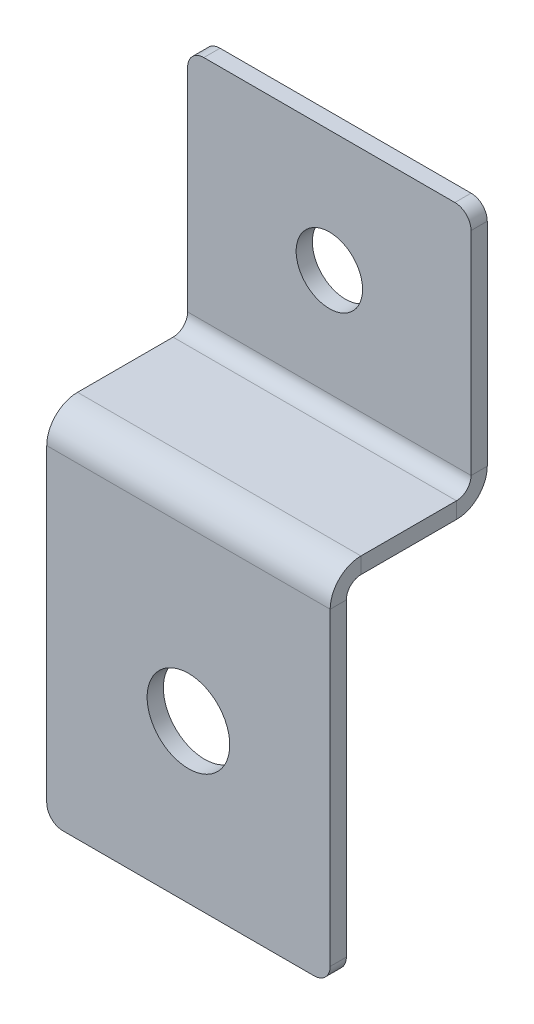
ISO-10303-21;
HEADER;
FILE_DESCRIPTION(('STEP AP214'),'2;1');
FILE_NAME('part.step','',(''),(''),'','','');
FILE_SCHEMA(('AUTOMOTIVE_DESIGN { 1 0 10303 214 1 1 1 1 }'));
ENDSEC;
DATA;
#1=APPLICATION_CONTEXT('core data for automotive mechanical design processes');
#2=APPLICATION_PROTOCOL_DEFINITION('international standard','automotive_design',2000,#1);
#3=PRODUCT_CONTEXT('',#1,'mechanical');
#4=PRODUCT('Part','Part','',(#3));
#5=PRODUCT_RELATED_PRODUCT_CATEGORY('part','',(#4));
#6=PRODUCT_DEFINITION_FORMATION('','',#4);
#7=PRODUCT_DEFINITION_CONTEXT('part definition',#1,'design');
#8=PRODUCT_DEFINITION('design','',#6,#7);
#9=PRODUCT_DEFINITION_SHAPE('','',#8);
#10=(LENGTH_UNIT() NAMED_UNIT(*) SI_UNIT(.MILLI.,.METRE.));
#11=(NAMED_UNIT(*) PLANE_ANGLE_UNIT() SI_UNIT($,.RADIAN.));
#12=(NAMED_UNIT(*) SI_UNIT($,.STERADIAN.) SOLID_ANGLE_UNIT());
#13=UNCERTAINTY_MEASURE_WITH_UNIT(LENGTH_MEASURE(1.E-05),#10,'distance_accuracy_value','');
#14=(GEOMETRIC_REPRESENTATION_CONTEXT(3) GLOBAL_UNCERTAINTY_ASSIGNED_CONTEXT((#13)) GLOBAL_UNIT_ASSIGNED_CONTEXT((#10,
#11,#12)) REPRESENTATION_CONTEXT('',''));
#15=CARTESIAN_POINT('',(0.,0.,0.));
#16=DIRECTION('',(0.,0.,1.));
#17=DIRECTION('',(1.,0.,0.));
#18=AXIS2_PLACEMENT_3D('',#15,#16,#17);
#19=CARTESIAN_POINT('',(16.609301381452,9.70798729366106,4.08315141283165));
#20=DIRECTION('',(1.,0.,0.));
#21=DIRECTION('',(0.,0.,-1.));
#22=AXIS2_PLACEMENT_3D('',#19,#20,#21);
#23=PLANE('',#22);
#24=DIRECTION('',(0.,-1.,0.));
#25=VECTOR('',#24,1.);
#26=CARTESIAN_POINT('',(16.609301381452,9.70798729366106,4.08315141283165));
#27=LINE('',#26,#25);
#28=CARTESIAN_POINT('',(16.609301381452,9.70798729366106,4.08315141283165));
#29=VERTEX_POINT('',#28);
#30=CARTESIAN_POINT('',(16.609301381452,7.70798729366106,4.08315141283165));
#31=VERTEX_POINT('',#30);
#32=EDGE_CURVE('E249',#29,#31,#27,.T.);
#33=ORIENTED_EDGE('',*,*,#32,.F.);
#34=CARTESIAN_POINT('',(16.609301381452,5.90798729366106,4.08315141283165));
#35=DIRECTION('',(1.,0.,0.));
#36=DIRECTION('',(0.,0.,-1.));
#37=AXIS2_PLACEMENT_3D('',#34,#35,#36);
#38=CIRCLE('',#37,3.8);
#39=CARTESIAN_POINT('',(16.609301381452,5.90798729366106,7.88315141283165));
#40=VERTEX_POINT('',#39);
#41=EDGE_CURVE('E165',#40,#29,#38,.F.);
#42=ORIENTED_EDGE('',*,*,#41,.F.);
#43=DIRECTION('',(0.,0.,1.));
#44=VECTOR('',#43,1.);
#45=CARTESIAN_POINT('',(16.609301381452,5.90798729366106,5.88315141283165));
#46=LINE('',#45,#44);
#47=CARTESIAN_POINT('',(16.609301381452,5.90798729366106,5.88315141283165));
#48=VERTEX_POINT('',#47);
#49=EDGE_CURVE('E246',#48,#40,#46,.T.);
#50=ORIENTED_EDGE('',*,*,#49,.F.);
#51=CARTESIAN_POINT('',(16.609301381452,5.90798729366106,4.08315141283165));
#52=DIRECTION('',(1.,0.,0.));
#53=DIRECTION('',(0.,0.,-1.));
#54=AXIS2_PLACEMENT_3D('',#51,#52,#53);
#55=CIRCLE('',#54,1.8);
#56=EDGE_CURVE('E175',#48,#31,#55,.F.);
#57=ORIENTED_EDGE('',*,*,#56,.T.);
#58=EDGE_LOOP('',(#33,#42,#50,#57));
#59=FACE_BOUND('',#58,.T.);
#60=ADVANCED_FACE('F16',(#59),#23,.T.);
#61=CARTESIAN_POINT('',(16.609301381452,5.90798729366106,5.88315141283165));
#62=DIRECTION('',(1.,0.,0.));
#63=DIRECTION('',(0.,0.,-1.));
#64=AXIS2_PLACEMENT_3D('',#61,#62,#63);
#65=PLANE('',#64);
#66=DIRECTION('',(0.,0.,-1.));
#67=VECTOR('',#66,1.);
#68=CARTESIAN_POINT('',(16.609301381452,9.70798729366106,7.88315141283165));
#69=LINE('',#68,#67);
#70=CARTESIAN_POINT('',(16.609301381452,9.70798729366106,-7.71684858716835));
#71=VERTEX_POINT('',#70);
#72=EDGE_CURVE('E163',#29,#71,#69,.T.);
#73=ORIENTED_EDGE('',*,*,#72,.F.);
#74=ORIENTED_EDGE('',*,*,#32,.T.);
#75=DIRECTION('',(0.,0.,-1.));
#76=VECTOR('',#75,1.);
#77=CARTESIAN_POINT('',(16.609301381452,7.70798729366106,7.88315141283165));
#78=LINE('',#77,#76);
#79=CARTESIAN_POINT('',(16.609301381452,7.70798729366107,-7.71684858716835));
#80=VERTEX_POINT('',#79);
#81=EDGE_CURVE('E178',#31,#80,#78,.T.);
#82=ORIENTED_EDGE('',*,*,#81,.T.);
#83=DIRECTION('',(0.,1.,0.));
#84=VECTOR('',#83,1.);
#85=CARTESIAN_POINT('',(16.609301381452,7.70798729366107,-7.71684858716835));
#86=LINE('',#85,#84);
#87=EDGE_CURVE('E143',#80,#71,#86,.T.);
#88=ORIENTED_EDGE('',*,*,#87,.T.);
#89=EDGE_LOOP('',(#73,#74,#82,#88));
#90=FACE_BOUND('',#89,.T.);
#91=ADVANCED_FACE('F323',(#90),#65,.T.);
#92=CARTESIAN_POINT('',(-18.390698618548,5.90798729366106,7.88315141283165));
#93=DIRECTION('',(-1.,0.,0.));
#94=DIRECTION('',(0.,0.,1.));
#95=AXIS2_PLACEMENT_3D('',#92,#93,#94);
#96=PLANE('',#95);
#97=DIRECTION('',(0.,0.,-1.));
#98=VECTOR('',#97,1.);
#99=CARTESIAN_POINT('',(-18.390698618548,5.90798729366106,7.88315141283165));
#100=LINE('',#99,#98);
#101=CARTESIAN_POINT('',(-18.390698618548,5.90798729366106,7.88315141283165));
#102=VERTEX_POINT('',#101);
#103=CARTESIAN_POINT('',(-18.390698618548,5.90798729366106,5.88315141283165));
#104=VERTEX_POINT('',#103);
#105=EDGE_CURVE('E243',#102,#104,#100,.T.);
#106=ORIENTED_EDGE('',*,*,#105,.F.);
#107=CARTESIAN_POINT('',(-18.390698618548,5.90798729366106,4.08315141283165));
#108=DIRECTION('',(1.,0.,0.));
#109=DIRECTION('',(0.,0.,-1.));
#110=AXIS2_PLACEMENT_3D('',#107,#108,#109);
#111=CIRCLE('',#110,3.8);
#112=CARTESIAN_POINT('',(-18.390698618548,9.70798729366106,4.08315141283165));
#113=VERTEX_POINT('',#112);
#114=EDGE_CURVE('E193',#102,#113,#111,.F.);
#115=ORIENTED_EDGE('',*,*,#114,.T.);
#116=DIRECTION('',(0.,1.,0.));
#117=VECTOR('',#116,1.);
#118=CARTESIAN_POINT('',(-18.390698618548,7.70798729366106,4.08315141283165));
#119=LINE('',#118,#117);
#120=CARTESIAN_POINT('',(-18.390698618548,7.70798729366106,4.08315141283165));
#121=VERTEX_POINT('',#120);
#122=EDGE_CURVE('E142',#121,#113,#119,.T.);
#123=ORIENTED_EDGE('',*,*,#122,.F.);
#124=CARTESIAN_POINT('',(-18.390698618548,5.90798729366106,4.08315141283165));
#125=DIRECTION('',(1.,0.,0.));
#126=DIRECTION('',(0.,0.,-1.));
#127=AXIS2_PLACEMENT_3D('',#124,#125,#126);
#128=CIRCLE('',#127,1.8);
#129=EDGE_CURVE('E200',#104,#121,#128,.F.);
#130=ORIENTED_EDGE('',*,*,#129,.F.);
#131=EDGE_LOOP('',(#106,#115,#123,#130));
#132=FACE_BOUND('',#131,.T.);
#133=ADVANCED_FACE('F329',(#132),#96,.T.);
#134=CARTESIAN_POINT('',(-18.390698618548,7.70798729366106,4.08315141283165));
#135=DIRECTION('',(-1.,0.,0.));
#136=DIRECTION('',(0.,0.,1.));
#137=AXIS2_PLACEMENT_3D('',#134,#135,#136);
#138=PLANE('',#137);
#139=DIRECTION('',(0.,1.,0.));
#140=VECTOR('',#139,1.);
#141=CARTESIAN_POINT('',(-18.390698618548,-34.2920127063389,5.88315141283165));
#142=LINE('',#141,#140);
#143=CARTESIAN_POINT('',(-18.390698618548,-32.2920127063389,5.88315141283165));
#144=VERTEX_POINT('',#143);
#145=EDGE_CURVE('E198',#144,#104,#142,.T.);
#146=ORIENTED_EDGE('',*,*,#145,.F.);
#147=DIRECTION('',(0.,0.,1.));
#148=VECTOR('',#147,1.);
#149=CARTESIAN_POINT('',(-18.390698618548,-32.2920127063389,4.08315141283165));
#150=LINE('',#149,#148);
#151=CARTESIAN_POINT('',(-18.390698618548,-32.2920127063389,7.88315141283165));
#152=VERTEX_POINT('',#151);
#153=EDGE_CURVE('E269',#144,#152,#150,.T.);
#154=ORIENTED_EDGE('',*,*,#153,.T.);
#155=DIRECTION('',(0.,1.,0.));
#156=VECTOR('',#155,1.);
#157=CARTESIAN_POINT('',(-18.390698618548,-34.2920127063389,7.88315141283165));
#158=LINE('',#157,#156);
#159=EDGE_CURVE('E196',#152,#102,#158,.T.);
#160=ORIENTED_EDGE('',*,*,#159,.T.);
#161=ORIENTED_EDGE('',*,*,#105,.T.);
#162=EDGE_LOOP('',(#146,#154,#160,#161));
#163=FACE_BOUND('',#162,.T.);
#164=ADVANCED_FACE('F389',(#163),#138,.T.);
#165=CARTESIAN_POINT('',(16.609301381452,11.5079872936611,-9.51684858716835));
#166=DIRECTION('',(1.,0.,0.));
#167=DIRECTION('',(0.,0.,-1.));
#168=AXIS2_PLACEMENT_3D('',#165,#166,#167);
#169=PLANE('',#168);
#170=DIRECTION('',(0.,0.,-1.));
#171=VECTOR('',#170,1.);
#172=CARTESIAN_POINT('',(16.609301381452,11.5079872936611,-9.51684858716835));
#173=LINE('',#172,#171);
#174=CARTESIAN_POINT('',(16.609301381452,11.5079872936611,-9.51684858716835));
#175=VERTEX_POINT('',#174);
#176=CARTESIAN_POINT('',(16.609301381452,11.5079872936611,-11.5168485871684));
#177=VERTEX_POINT('',#176);
#178=EDGE_CURVE('E133',#175,#177,#173,.T.);
#179=ORIENTED_EDGE('',*,*,#178,.F.);
#180=CARTESIAN_POINT('',(16.609301381452,11.5079872936611,-7.71684858716835));
#181=DIRECTION('',(-1.,0.,0.));
#182=DIRECTION('',(0.,0.,1.));
#183=AXIS2_PLACEMENT_3D('',#180,#181,#182);
#184=CIRCLE('',#183,1.8);
#185=EDGE_CURVE('E137',#71,#175,#184,.F.);
#186=ORIENTED_EDGE('',*,*,#185,.F.);
#187=ORIENTED_EDGE('',*,*,#87,.F.);
#188=CARTESIAN_POINT('',(16.609301381452,11.5079872936611,-7.71684858716835));
#189=DIRECTION('',(1.,0.,0.));
#190=DIRECTION('',(0.,0.,-1.));
#191=AXIS2_PLACEMENT_3D('',#188,#189,#190);
#192=CIRCLE('',#191,3.8);
#193=EDGE_CURVE('E140',#80,#177,#192,.T.);
#194=ORIENTED_EDGE('',*,*,#193,.T.);
#195=EDGE_LOOP('',(#179,#186,#187,#194));
#196=FACE_BOUND('',#195,.T.);
#197=ADVANCED_FACE('F135',(#196),#169,.T.);
#198=CARTESIAN_POINT('',(16.609301381452,7.70798729366107,-7.71684858716835));
#199=DIRECTION('',(1.,0.,0.));
#200=DIRECTION('',(0.,0.,-1.));
#201=AXIS2_PLACEMENT_3D('',#198,#199,#200);
#202=PLANE('',#201);
#203=DIRECTION('',(0.,1.,0.));
#204=VECTOR('',#203,1.);
#205=CARTESIAN_POINT('',(16.609301381452,9.70798729366106,-11.5168485871684));
#206=LINE('',#205,#204);
#207=CARTESIAN_POINT('',(16.609301381452,37.7079872936611,-11.5168485871684));
#208=VERTEX_POINT('',#207);
#209=EDGE_CURVE('E158',#177,#208,#206,.T.);
#210=ORIENTED_EDGE('',*,*,#209,.T.);
#211=DIRECTION('',(0.,0.,-1.));
#212=VECTOR('',#211,1.);
#213=CARTESIAN_POINT('',(16.609301381452,37.7079872936611,-7.71684858716835));
#214=LINE('',#213,#212);
#215=CARTESIAN_POINT('',(16.609301381452,37.7079872936611,-9.51684858716835));
#216=VERTEX_POINT('',#215);
#217=EDGE_CURVE('E39',#208,#216,#214,.F.);
#218=ORIENTED_EDGE('',*,*,#217,.T.);
#219=DIRECTION('',(0.,1.,0.));
#220=VECTOR('',#219,1.);
#221=CARTESIAN_POINT('',(16.609301381452,9.70798729366106,-9.51684858716835));
#222=LINE('',#221,#220);
#223=EDGE_CURVE('E148',#175,#216,#222,.T.);
#224=ORIENTED_EDGE('',*,*,#223,.F.);
#225=ORIENTED_EDGE('',*,*,#178,.T.);
#226=EDGE_LOOP('',(#210,#218,#224,#225));
#227=FACE_BOUND('',#226,.T.);
#228=ADVANCED_FACE('F157',(#227),#202,.T.);
#229=CARTESIAN_POINT('',(-18.390698618548,9.70798729366106,-7.71684858716835));
#230=DIRECTION('',(-1.,0.,0.));
#231=DIRECTION('',(0.,0.,1.));
#232=AXIS2_PLACEMENT_3D('',#229,#230,#231);
#233=PLANE('',#232);
#234=DIRECTION('',(0.,-1.,0.));
#235=VECTOR('',#234,1.);
#236=CARTESIAN_POINT('',(-18.390698618548,9.70798729366106,-7.71684858716835));
#237=LINE('',#236,#235);
#238=CARTESIAN_POINT('',(-18.390698618548,9.70798729366106,-7.71684858716835));
#239=VERTEX_POINT('',#238);
#240=CARTESIAN_POINT('',(-18.390698618548,7.70798729366107,-7.71684858716835));
#241=VERTEX_POINT('',#240);
#242=EDGE_CURVE('E239',#239,#241,#237,.T.);
#243=ORIENTED_EDGE('',*,*,#242,.F.);
#244=CARTESIAN_POINT('',(-18.390698618548,11.5079872936611,-7.71684858716835));
#245=DIRECTION('',(-1.,0.,0.));
#246=DIRECTION('',(0.,0.,1.));
#247=AXIS2_PLACEMENT_3D('',#244,#245,#246);
#248=CIRCLE('',#247,1.8);
#249=CARTESIAN_POINT('',(-18.390698618548,11.5079872936611,-9.51684858716835));
#250=VERTEX_POINT('',#249);
#251=EDGE_CURVE('E188',#239,#250,#248,.F.);
#252=ORIENTED_EDGE('',*,*,#251,.T.);
#253=DIRECTION('',(0.,0.,1.));
#254=VECTOR('',#253,1.);
#255=CARTESIAN_POINT('',(-18.390698618548,11.5079872936611,-11.5168485871684));
#256=LINE('',#255,#254);
#257=CARTESIAN_POINT('',(-18.390698618548,11.5079872936611,-11.5168485871684));
#258=VERTEX_POINT('',#257);
#259=EDGE_CURVE('E237',#258,#250,#256,.T.);
#260=ORIENTED_EDGE('',*,*,#259,.F.);
#261=CARTESIAN_POINT('',(-18.390698618548,11.5079872936611,-7.71684858716835));
#262=DIRECTION('',(1.,0.,0.));
#263=DIRECTION('',(0.,0.,-1.));
#264=AXIS2_PLACEMENT_3D('',#261,#262,#263);
#265=CIRCLE('',#264,3.8);
#266=EDGE_CURVE('E206',#241,#258,#265,.T.);
#267=ORIENTED_EDGE('',*,*,#266,.F.);
#268=EDGE_LOOP('',(#243,#252,#260,#267));
#269=FACE_BOUND('',#268,.T.);
#270=ADVANCED_FACE('F356',(#269),#233,.T.);
#271=CARTESIAN_POINT('',(-18.390698618548,11.5079872936611,-11.5168485871684));
#272=DIRECTION('',(-1.,0.,0.));
#273=DIRECTION('',(0.,0.,1.));
#274=AXIS2_PLACEMENT_3D('',#271,#272,#273);
#275=PLANE('',#274);
#276=DIRECTION('',(0.,0.,-1.));
#277=VECTOR('',#276,1.);
#278=CARTESIAN_POINT('',(-18.390698618548,9.70798729366106,7.88315141283165));
#279=LINE('',#278,#277);
#280=EDGE_CURVE('E190',#113,#239,#279,.T.);
#281=ORIENTED_EDGE('',*,*,#280,.T.);
#282=ORIENTED_EDGE('',*,*,#242,.T.);
#283=DIRECTION('',(0.,0.,-1.));
#284=VECTOR('',#283,1.);
#285=CARTESIAN_POINT('',(-18.390698618548,7.70798729366106,7.88315141283165));
#286=LINE('',#285,#284);
#287=EDGE_CURVE('E203',#121,#241,#286,.T.);
#288=ORIENTED_EDGE('',*,*,#287,.F.);
#289=ORIENTED_EDGE('',*,*,#122,.T.);
#290=EDGE_LOOP('',(#281,#282,#288,#289));
#291=FACE_BOUND('',#290,.T.);
#292=ADVANCED_FACE('F359',(#291),#275,.T.);
#293=CARTESIAN_POINT('',(16.609301381452,9.70798729366106,-11.5168485871684));
#294=DIRECTION('',(0.,0.,1.));
#295=DIRECTION('',(1.,0.,0.));
#296=AXIS2_PLACEMENT_3D('',#293,#294,#295);
#297=PLANE('',#296);
#298=CARTESIAN_POINT('',(-0.890698618547958,24.7079872936611,-11.5168485871684));
#299=DIRECTION('',(0.,0.,1.));
#300=DIRECTION('',(1.,0.,0.));
#301=AXIS2_PLACEMENT_3D('',#298,#299,#300);
#302=CIRCLE('',#301,4.1);
#303=CARTESIAN_POINT('',(3.20930138145204,24.7079872936611,-11.5168485871684));
#304=VERTEX_POINT('',#303);
#305=EDGE_CURVE('E296',#304,#304,#302,.T.);
#306=ORIENTED_EDGE('',*,*,#305,.T.);
#307=EDGE_LOOP('',(#306));
#308=FACE_BOUND('',#307,.T.);
#309=DIRECTION('',(-1.,0.,0.));
#310=VECTOR('',#309,1.);
#311=CARTESIAN_POINT('',(16.609301381452,39.7079872936611,-11.5168485871684));
#312=LINE('',#311,#310);
#313=CARTESIAN_POINT('',(14.609301381452,39.7079872936611,-11.5168485871684));
#314=VERTEX_POINT('',#313);
#315=CARTESIAN_POINT('',(-16.390698618548,39.7079872936611,-11.5168485871684));
#316=VERTEX_POINT('',#315);
#317=EDGE_CURVE('E234',#314,#316,#312,.T.);
#318=ORIENTED_EDGE('',*,*,#317,.F.);
#319=CARTESIAN_POINT('',(14.609301381452,37.7079872936611,-11.5168485871684));
#320=DIRECTION('',(0.,0.,1.));
#321=DIRECTION('',(1.,0.,0.));
#322=AXIS2_PLACEMENT_3D('',#319,#320,#321);
#323=CIRCLE('',#322,2.);
#324=EDGE_CURVE('E279',#314,#208,#323,.F.);
#325=ORIENTED_EDGE('',*,*,#324,.T.);
#326=ORIENTED_EDGE('',*,*,#209,.F.);
#327=DIRECTION('',(-1.,0.,0.));
#328=VECTOR('',#327,1.);
#329=CARTESIAN_POINT('',(16.609301381452,11.5079872936611,-11.5168485871684));
#330=LINE('',#329,#328);
#331=EDGE_CURVE('E182',#177,#258,#330,.T.);
#332=ORIENTED_EDGE('',*,*,#331,.T.);
#333=DIRECTION('',(0.,1.,0.));
#334=VECTOR('',#333,1.);
#335=CARTESIAN_POINT('',(-18.390698618548,9.70798729366106,-11.5168485871684));
#336=LINE('',#335,#334);
#337=CARTESIAN_POINT('',(-18.390698618548,37.7079872936611,-11.5168485871684));
#338=VERTEX_POINT('',#337);
#339=EDGE_CURVE('E183',#258,#338,#336,.T.);
#340=ORIENTED_EDGE('',*,*,#339,.T.);
#341=CARTESIAN_POINT('',(-16.390698618548,37.7079872936611,-11.5168485871684));
#342=DIRECTION('',(0.,0.,1.));
#343=DIRECTION('',(1.,0.,0.));
#344=AXIS2_PLACEMENT_3D('',#341,#342,#343);
#345=CIRCLE('',#344,2.);
#346=EDGE_CURVE('E277',#338,#316,#345,.F.);
#347=ORIENTED_EDGE('',*,*,#346,.T.);
#348=EDGE_LOOP('',(#318,#325,#326,#332,#340,#347));
#349=FACE_BOUND('',#348,.T.);
#350=ADVANCED_FACE('F292',(#308,#349),#297,.F.);
#351=CARTESIAN_POINT('',(16.609301381452,39.7079872936611,-9.51684858716835));
#352=DIRECTION('',(0.,1.,0.));
#353=DIRECTION('',(0.,0.,1.));
#354=AXIS2_PLACEMENT_3D('',#351,#352,#353);
#355=PLANE('',#354);
#356=DIRECTION('',(-1.,0.,0.));
#357=VECTOR('',#356,1.);
#358=CARTESIAN_POINT('',(16.609301381452,39.7079872936611,-9.51684858716835));
#359=LINE('',#358,#357);
#360=CARTESIAN_POINT('',(14.609301381452,39.7079872936611,-9.51684858716835));
#361=VERTEX_POINT('',#360);
#362=CARTESIAN_POINT('',(-16.390698618548,39.7079872936611,-9.51684858716835));
#363=VERTEX_POINT('',#362);
#364=EDGE_CURVE('E154',#361,#363,#359,.T.);
#365=ORIENTED_EDGE('',*,*,#364,.F.);
#366=DIRECTION('',(0.,0.,-1.));
#367=VECTOR('',#366,1.);
#368=CARTESIAN_POINT('',(14.609301381452,39.7079872936611,-9.51684858716835));
#369=LINE('',#368,#367);
#370=EDGE_CURVE('E274',#361,#314,#369,.T.);
#371=ORIENTED_EDGE('',*,*,#370,.T.);
#372=ORIENTED_EDGE('',*,*,#317,.T.);
#373=DIRECTION('',(0.,0.,-1.));
#374=VECTOR('',#373,1.);
#375=CARTESIAN_POINT('',(-16.390698618548,39.7079872936611,-9.51684858716835));
#376=LINE('',#375,#374);
#377=EDGE_CURVE('E272',#316,#363,#376,.F.);
#378=ORIENTED_EDGE('',*,*,#377,.T.);
#379=EDGE_LOOP('',(#365,#371,#372,#378));
#380=FACE_BOUND('',#379,.T.);
#381=ADVANCED_FACE('F286',(#380),#355,.T.);
#382=CARTESIAN_POINT('',(16.609301381452,9.70798729366106,-9.51684858716835));
#383=DIRECTION('',(0.,0.,1.));
#384=DIRECTION('',(1.,0.,0.));
#385=AXIS2_PLACEMENT_3D('',#382,#383,#384);
#386=PLANE('',#385);
#387=CARTESIAN_POINT('',(-0.890698618547958,24.7079872936611,-9.51684858716835));
#388=DIRECTION('',(0.,0.,1.));
#389=DIRECTION('',(1.,0.,0.));
#390=AXIS2_PLACEMENT_3D('',#387,#388,#389);
#391=CIRCLE('',#390,4.1);
#392=CARTESIAN_POINT('',(3.20930138145204,24.7079872936611,-9.51684858716835));
#393=VERTEX_POINT('',#392);
#394=EDGE_CURVE('E297',#393,#393,#391,.T.);
#395=ORIENTED_EDGE('',*,*,#394,.F.);
#396=EDGE_LOOP('',(#395));
#397=FACE_BOUND('',#396,.T.);
#398=ORIENTED_EDGE('',*,*,#223,.T.);
#399=CARTESIAN_POINT('',(14.609301381452,37.7079872936611,-9.51684858716835));
#400=DIRECTION('',(0.,0.,1.));
#401=DIRECTION('',(1.,0.,0.));
#402=AXIS2_PLACEMENT_3D('',#399,#400,#401);
#403=CIRCLE('',#402,2.);
#404=EDGE_CURVE('E24',#216,#361,#403,.T.);
#405=ORIENTED_EDGE('',*,*,#404,.T.);
#406=ORIENTED_EDGE('',*,*,#364,.T.);
#407=CARTESIAN_POINT('',(-16.390698618548,37.7079872936611,-9.51684858716835));
#408=DIRECTION('',(0.,0.,1.));
#409=DIRECTION('',(1.,0.,0.));
#410=AXIS2_PLACEMENT_3D('',#407,#408,#409);
#411=CIRCLE('',#410,2.);
#412=CARTESIAN_POINT('',(-18.390698618548,37.7079872936611,-9.51684858716835));
#413=VERTEX_POINT('',#412);
#414=EDGE_CURVE('E31',#363,#413,#411,.T.);
#415=ORIENTED_EDGE('',*,*,#414,.T.);
#416=DIRECTION('',(0.,1.,0.));
#417=VECTOR('',#416,1.);
#418=CARTESIAN_POINT('',(-18.390698618548,9.70798729366106,-9.51684858716835));
#419=LINE('',#418,#417);
#420=EDGE_CURVE('E150',#250,#413,#419,.T.);
#421=ORIENTED_EDGE('',*,*,#420,.F.);
#422=DIRECTION('',(-1.,0.,0.));
#423=VECTOR('',#422,1.);
#424=CARTESIAN_POINT('',(16.609301381452,11.5079872936611,-9.51684858716835));
#425=LINE('',#424,#423);
#426=EDGE_CURVE('E146',#175,#250,#425,.T.);
#427=ORIENTED_EDGE('',*,*,#426,.F.);
#428=EDGE_LOOP('',(#398,#405,#406,#415,#421,#427));
#429=FACE_BOUND('',#428,.T.);
#430=ADVANCED_FACE('F147',(#397,#429),#386,.T.);
#431=CARTESIAN_POINT('',(16.609301381452,11.5079872936611,-7.71684858716835));
#432=DIRECTION('',(-1.,0.,0.));
#433=DIRECTION('',(0.,0.,1.));
#434=AXIS2_PLACEMENT_3D('',#431,#432,#433);
#435=CYLINDRICAL_SURFACE('',#434,1.8);
#436=ORIENTED_EDGE('',*,*,#251,.F.);
#437=DIRECTION('',(-1.,0.,0.));
#438=VECTOR('',#437,1.);
#439=CARTESIAN_POINT('',(16.609301381452,9.70798729366106,-7.71684858716835));
#440=LINE('',#439,#438);
#441=EDGE_CURVE('E155',#71,#239,#440,.T.);
#442=ORIENTED_EDGE('',*,*,#441,.F.);
#443=ORIENTED_EDGE('',*,*,#185,.T.);
#444=ORIENTED_EDGE('',*,*,#426,.T.);
#445=EDGE_LOOP('',(#436,#442,#443,#444));
#446=FACE_BOUND('',#445,.T.);
#447=ADVANCED_FACE('F161',(#446),#435,.F.);
#448=CARTESIAN_POINT('',(16.609301381452,9.70798729366106,7.88315141283165));
#449=DIRECTION('',(0.,1.,0.));
#450=DIRECTION('',(0.,0.,1.));
#451=AXIS2_PLACEMENT_3D('',#448,#449,#450);
#452=PLANE('',#451);
#453=ORIENTED_EDGE('',*,*,#280,.F.);
#454=DIRECTION('',(-1.,0.,0.));
#455=VECTOR('',#454,1.);
#456=CARTESIAN_POINT('',(16.609301381452,9.70798729366106,4.08315141283165));
#457=LINE('',#456,#455);
#458=EDGE_CURVE('E229',#29,#113,#457,.T.);
#459=ORIENTED_EDGE('',*,*,#458,.F.);
#460=ORIENTED_EDGE('',*,*,#72,.T.);
#461=ORIENTED_EDGE('',*,*,#441,.T.);
#462=EDGE_LOOP('',(#453,#459,#460,#461));
#463=FACE_BOUND('',#462,.T.);
#464=ADVANCED_FACE('F319',(#463),#452,.T.);
#465=CARTESIAN_POINT('',(16.609301381452,5.90798729366106,4.08315141283165));
#466=DIRECTION('',(-1.,0.,0.));
#467=DIRECTION('',(0.,0.,1.));
#468=AXIS2_PLACEMENT_3D('',#465,#466,#467);
#469=CYLINDRICAL_SURFACE('',#468,3.8);
#470=ORIENTED_EDGE('',*,*,#114,.F.);
#471=DIRECTION('',(-1.,0.,0.));
#472=VECTOR('',#471,1.);
#473=CARTESIAN_POINT('',(16.609301381452,5.90798729366106,7.88315141283165));
#474=LINE('',#473,#472);
#475=EDGE_CURVE('E226',#40,#102,#474,.T.);
#476=ORIENTED_EDGE('',*,*,#475,.F.);
#477=ORIENTED_EDGE('',*,*,#41,.T.);
#478=ORIENTED_EDGE('',*,*,#458,.T.);
#479=EDGE_LOOP('',(#470,#476,#477,#478));
#480=FACE_BOUND('',#479,.T.);
#481=ADVANCED_FACE('F370',(#480),#469,.T.);
#482=CARTESIAN_POINT('',(16.609301381452,-34.2920127063389,7.88315141283165));
#483=DIRECTION('',(0.,0.,1.));
#484=DIRECTION('',(1.,0.,0.));
#485=AXIS2_PLACEMENT_3D('',#482,#483,#484);
#486=PLANE('',#485);
#487=CARTESIAN_POINT('',(-0.890698618547958,-14.7920127063389,7.88315141283165));
#488=DIRECTION('',(0.,0.,1.));
#489=DIRECTION('',(1.,0.,0.));
#490=AXIS2_PLACEMENT_3D('',#487,#488,#489);
#491=CIRCLE('',#490,5.1);
#492=CARTESIAN_POINT('',(4.20930138145204,-14.7920127063389,7.88315141283165));
#493=VERTEX_POINT('',#492);
#494=EDGE_CURVE('E254',#493,#493,#491,.T.);
#495=ORIENTED_EDGE('',*,*,#494,.F.);
#496=EDGE_LOOP('',(#495));
#497=FACE_BOUND('',#496,.T.);
#498=DIRECTION('',(-1.,0.,0.));
#499=VECTOR('',#498,1.);
#500=CARTESIAN_POINT('',(16.609301381452,-34.2920127063389,7.88315141283165));
#501=LINE('',#500,#499);
#502=CARTESIAN_POINT('',(14.609301381452,-34.2920127063389,7.88315141283165));
#503=VERTEX_POINT('',#502);
#504=CARTESIAN_POINT('',(-16.390698618548,-34.2920127063389,7.88315141283165));
#505=VERTEX_POINT('',#504);
#506=EDGE_CURVE('E223',#503,#505,#501,.T.);
#507=ORIENTED_EDGE('',*,*,#506,.F.);
#508=CARTESIAN_POINT('',(14.609301381452,-32.2920127063389,7.88315141283165));
#509=DIRECTION('',(0.,0.,1.));
#510=DIRECTION('',(1.,0.,0.));
#511=AXIS2_PLACEMENT_3D('',#508,#509,#510);
#512=CIRCLE('',#511,2.);
#513=CARTESIAN_POINT('',(16.609301381452,-32.2920127063389,7.88315141283165));
#514=VERTEX_POINT('',#513);
#515=EDGE_CURVE('E261',#503,#514,#512,.T.);
#516=ORIENTED_EDGE('',*,*,#515,.T.);
#517=DIRECTION('',(0.,1.,0.));
#518=VECTOR('',#517,1.);
#519=CARTESIAN_POINT('',(16.609301381452,-34.2920127063389,7.88315141283165));
#520=LINE('',#519,#518);
#521=EDGE_CURVE('E171',#514,#40,#520,.T.);
#522=ORIENTED_EDGE('',*,*,#521,.T.);
#523=ORIENTED_EDGE('',*,*,#475,.T.);
#524=ORIENTED_EDGE('',*,*,#159,.F.);
#525=CARTESIAN_POINT('',(-16.390698618548,-32.2920127063389,7.88315141283165));
#526=DIRECTION('',(0.,0.,1.));
#527=DIRECTION('',(1.,0.,0.));
#528=AXIS2_PLACEMENT_3D('',#525,#526,#527);
#529=CIRCLE('',#528,2.);
#530=EDGE_CURVE('E259',#152,#505,#529,.T.);
#531=ORIENTED_EDGE('',*,*,#530,.T.);
#532=EDGE_LOOP('',(#507,#516,#522,#523,#524,#531));
#533=FACE_BOUND('',#532,.T.);
#534=ADVANCED_FACE('F393',(#497,#533),#486,.T.);
#535=CARTESIAN_POINT('',(16.609301381452,-34.2920127063389,5.88315141283165));
#536=DIRECTION('',(0.,-1.,0.));
#537=DIRECTION('',(0.,0.,-1.));
#538=AXIS2_PLACEMENT_3D('',#535,#536,#537);
#539=PLANE('',#538);
#540=DIRECTION('',(-1.,0.,0.));
#541=VECTOR('',#540,1.);
#542=CARTESIAN_POINT('',(16.609301381452,-34.2920127063389,5.88315141283165));
#543=LINE('',#542,#541);
#544=CARTESIAN_POINT('',(14.609301381452,-34.2920127063389,5.88315141283165));
#545=VERTEX_POINT('',#544);
#546=CARTESIAN_POINT('',(-16.390698618548,-34.2920127063389,5.88315141283165));
#547=VERTEX_POINT('',#546);
#548=EDGE_CURVE('E220',#545,#547,#543,.T.);
#549=ORIENTED_EDGE('',*,*,#548,.F.);
#550=DIRECTION('',(0.,0.,1.));
#551=VECTOR('',#550,1.);
#552=CARTESIAN_POINT('',(14.609301381452,-34.2920127063389,7.88315141283165));
#553=LINE('',#552,#551);
#554=EDGE_CURVE('E256',#545,#503,#553,.T.);
#555=ORIENTED_EDGE('',*,*,#554,.T.);
#556=ORIENTED_EDGE('',*,*,#506,.T.);
#557=DIRECTION('',(0.,0.,1.));
#558=VECTOR('',#557,1.);
#559=CARTESIAN_POINT('',(-16.390698618548,-34.2920127063389,5.88315141283165));
#560=LINE('',#559,#558);
#561=EDGE_CURVE('E251',#505,#547,#560,.F.);
#562=ORIENTED_EDGE('',*,*,#561,.T.);
#563=EDGE_LOOP('',(#549,#555,#556,#562));
#564=FACE_BOUND('',#563,.T.);
#565=ADVANCED_FACE('F401',(#564),#539,.T.);
#566=CARTESIAN_POINT('',(16.609301381452,-34.2920127063389,5.88315141283165));
#567=DIRECTION('',(0.,0.,1.));
#568=DIRECTION('',(1.,0.,0.));
#569=AXIS2_PLACEMENT_3D('',#566,#567,#568);
#570=PLANE('',#569);
#571=CARTESIAN_POINT('',(-0.890698618547958,-14.7920127063389,5.88315141283165));
#572=DIRECTION('',(0.,0.,1.));
#573=DIRECTION('',(1.,0.,0.));
#574=AXIS2_PLACEMENT_3D('',#571,#572,#573);
#575=CIRCLE('',#574,5.1);
#576=CARTESIAN_POINT('',(4.20930138145204,-14.7920127063389,5.88315141283165));
#577=VERTEX_POINT('',#576);
#578=EDGE_CURVE('E186',#577,#577,#575,.T.);
#579=ORIENTED_EDGE('',*,*,#578,.T.);
#580=EDGE_LOOP('',(#579));
#581=FACE_BOUND('',#580,.T.);
#582=DIRECTION('',(0.,1.,0.));
#583=VECTOR('',#582,1.);
#584=CARTESIAN_POINT('',(16.609301381452,-34.2920127063389,5.88315141283165));
#585=LINE('',#584,#583);
#586=CARTESIAN_POINT('',(16.609301381452,-32.2920127063389,5.88315141283165));
#587=VERTEX_POINT('',#586);
#588=EDGE_CURVE('E173',#587,#48,#585,.T.);
#589=ORIENTED_EDGE('',*,*,#588,.F.);
#590=CARTESIAN_POINT('',(14.609301381452,-32.2920127063389,5.88315141283165));
#591=DIRECTION('',(0.,0.,1.));
#592=DIRECTION('',(1.,0.,0.));
#593=AXIS2_PLACEMENT_3D('',#590,#591,#592);
#594=CIRCLE('',#593,2.);
#595=EDGE_CURVE('E267',#587,#545,#594,.F.);
#596=ORIENTED_EDGE('',*,*,#595,.T.);
#597=ORIENTED_EDGE('',*,*,#548,.T.);
#598=CARTESIAN_POINT('',(-16.390698618548,-32.2920127063389,5.88315141283165));
#599=DIRECTION('',(0.,0.,1.));
#600=DIRECTION('',(1.,0.,0.));
#601=AXIS2_PLACEMENT_3D('',#598,#599,#600);
#602=CIRCLE('',#601,2.);
#603=EDGE_CURVE('E265',#547,#144,#602,.F.);
#604=ORIENTED_EDGE('',*,*,#603,.T.);
#605=ORIENTED_EDGE('',*,*,#145,.T.);
#606=DIRECTION('',(-1.,0.,0.));
#607=VECTOR('',#606,1.);
#608=CARTESIAN_POINT('',(16.609301381452,5.90798729366106,5.88315141283165));
#609=LINE('',#608,#607);
#610=EDGE_CURVE('E217',#48,#104,#609,.T.);
#611=ORIENTED_EDGE('',*,*,#610,.F.);
#612=EDGE_LOOP('',(#589,#596,#597,#604,#605,#611));
#613=FACE_BOUND('',#612,.T.);
#614=ADVANCED_FACE('F383',(#581,#613),#570,.F.);
#615=CARTESIAN_POINT('',(16.609301381452,5.90798729366106,4.08315141283165));
#616=DIRECTION('',(-1.,0.,0.));
#617=DIRECTION('',(0.,0.,1.));
#618=AXIS2_PLACEMENT_3D('',#615,#616,#617);
#619=CYLINDRICAL_SURFACE('',#618,1.8);
#620=ORIENTED_EDGE('',*,*,#129,.T.);
#621=DIRECTION('',(-1.,0.,0.));
#622=VECTOR('',#621,1.);
#623=CARTESIAN_POINT('',(16.609301381452,7.70798729366106,4.08315141283165));
#624=LINE('',#623,#622);
#625=EDGE_CURVE('E214',#31,#121,#624,.T.);
#626=ORIENTED_EDGE('',*,*,#625,.F.);
#627=ORIENTED_EDGE('',*,*,#56,.F.);
#628=ORIENTED_EDGE('',*,*,#610,.T.);
#629=EDGE_LOOP('',(#620,#626,#627,#628));
#630=FACE_BOUND('',#629,.T.);
#631=ADVANCED_FACE('F380',(#630),#619,.F.);
#632=CARTESIAN_POINT('',(16.609301381452,7.70798729366106,7.88315141283165));
#633=DIRECTION('',(0.,1.,0.));
#634=DIRECTION('',(0.,0.,1.));
#635=AXIS2_PLACEMENT_3D('',#632,#633,#634);
#636=PLANE('',#635);
#637=ORIENTED_EDGE('',*,*,#287,.T.);
#638=DIRECTION('',(-1.,0.,0.));
#639=VECTOR('',#638,1.);
#640=CARTESIAN_POINT('',(16.609301381452,7.70798729366107,-7.71684858716835));
#641=LINE('',#640,#639);
#642=EDGE_CURVE('E211',#80,#241,#641,.T.);
#643=ORIENTED_EDGE('',*,*,#642,.F.);
#644=ORIENTED_EDGE('',*,*,#81,.F.);
#645=ORIENTED_EDGE('',*,*,#625,.T.);
#646=EDGE_LOOP('',(#637,#643,#644,#645));
#647=FACE_BOUND('',#646,.T.);
#648=ADVANCED_FACE('F378',(#647),#636,.F.);
#649=CARTESIAN_POINT('',(16.609301381452,11.5079872936611,-7.71684858716835));
#650=DIRECTION('',(-1.,0.,0.));
#651=DIRECTION('',(0.,0.,1.));
#652=AXIS2_PLACEMENT_3D('',#649,#650,#651);
#653=CYLINDRICAL_SURFACE('',#652,3.8);
#654=ORIENTED_EDGE('',*,*,#266,.T.);
#655=ORIENTED_EDGE('',*,*,#331,.F.);
#656=ORIENTED_EDGE('',*,*,#193,.F.);
#657=ORIENTED_EDGE('',*,*,#642,.T.);
#658=EDGE_LOOP('',(#654,#655,#656,#657));
#659=FACE_BOUND('',#658,.T.);
#660=ADVANCED_FACE('F352',(#659),#653,.T.);
#661=CARTESIAN_POINT('',(16.609301381452,11.5079872936611,-7.71684858716835));
#662=DIRECTION('',(-1.,0.,0.));
#663=DIRECTION('',(0.,0.,1.));
#664=AXIS2_PLACEMENT_3D('',#661,#662,#663);
#665=PLANE('',#664);
#666=ORIENTED_EDGE('',*,*,#521,.F.);
#667=DIRECTION('',(0.,0.,1.));
#668=VECTOR('',#667,1.);
#669=CARTESIAN_POINT('',(16.609301381452,-32.2920127063389,5.88315141283165));
#670=LINE('',#669,#668);
#671=EDGE_CURVE('E263',#514,#587,#670,.F.);
#672=ORIENTED_EDGE('',*,*,#671,.T.);
#673=ORIENTED_EDGE('',*,*,#588,.T.);
#674=ORIENTED_EDGE('',*,*,#49,.T.);
#675=EDGE_LOOP('',(#666,#672,#673,#674));
#676=FACE_BOUND('',#675,.T.);
#677=ADVANCED_FACE('F397',(#676),#665,.F.);
#678=CARTESIAN_POINT('',(-18.390698618548,11.5079872936611,-7.71684858716835));
#679=DIRECTION('',(-1.,0.,0.));
#680=DIRECTION('',(0.,0.,1.));
#681=AXIS2_PLACEMENT_3D('',#678,#679,#680);
#682=PLANE('',#681);
#683=ORIENTED_EDGE('',*,*,#420,.T.);
#684=DIRECTION('',(0.,0.,-1.));
#685=VECTOR('',#684,1.);
#686=CARTESIAN_POINT('',(-18.390698618548,37.7079872936611,-7.71684858716835));
#687=LINE('',#686,#685);
#688=EDGE_CURVE('E10',#413,#338,#687,.T.);
#689=ORIENTED_EDGE('',*,*,#688,.T.);
#690=ORIENTED_EDGE('',*,*,#339,.F.);
#691=ORIENTED_EDGE('',*,*,#259,.T.);
#692=EDGE_LOOP('',(#683,#689,#690,#691));
#693=FACE_BOUND('',#692,.T.);
#694=ADVANCED_FACE('F350',(#693),#682,.T.);
#695=CARTESIAN_POINT('',(-0.890698618547958,-14.7920127063389,-11.5168485871684));
#696=DIRECTION('',(0.,0.,1.));
#697=DIRECTION('',(1.,0.,0.));
#698=AXIS2_PLACEMENT_3D('',#695,#696,#697);
#699=CYLINDRICAL_SURFACE('',#698,5.1);
#700=ORIENTED_EDGE('',*,*,#494,.T.);
#701=EDGE_LOOP('',(#700));
#702=FACE_BOUND('',#701,.T.);
#703=ORIENTED_EDGE('',*,*,#578,.F.);
#704=EDGE_LOOP('',(#703));
#705=FACE_BOUND('',#704,.T.);
#706=ADVANCED_FACE('F308',(#702,#705),#699,.F.);
#707=CARTESIAN_POINT('',(-0.890698618547958,24.7079872936611,-11.5168485871684));
#708=DIRECTION('',(0.,0.,1.));
#709=DIRECTION('',(1.,0.,0.));
#710=AXIS2_PLACEMENT_3D('',#707,#708,#709);
#711=CYLINDRICAL_SURFACE('',#710,4.1);
#712=ORIENTED_EDGE('',*,*,#305,.F.);
#713=EDGE_LOOP('',(#712));
#714=FACE_BOUND('',#713,.T.);
#715=ORIENTED_EDGE('',*,*,#394,.T.);
#716=EDGE_LOOP('',(#715));
#717=FACE_BOUND('',#716,.T.);
#718=ADVANCED_FACE('F304',(#714,#717),#711,.F.);
#719=CARTESIAN_POINT('',(14.609301381452,-32.2920127063389,5.88315141283165));
#720=DIRECTION('',(0.,0.,-1.));
#721=DIRECTION('',(-1.,0.,0.));
#722=AXIS2_PLACEMENT_3D('',#719,#720,#721);
#723=CYLINDRICAL_SURFACE('',#722,2.);
#724=ORIENTED_EDGE('',*,*,#595,.F.);
#725=ORIENTED_EDGE('',*,*,#671,.F.);
#726=ORIENTED_EDGE('',*,*,#515,.F.);
#727=ORIENTED_EDGE('',*,*,#554,.F.);
#728=EDGE_LOOP('',(#724,#725,#726,#727));
#729=FACE_BOUND('',#728,.T.);
#730=ADVANCED_FACE('F307',(#729),#723,.T.);
#731=CARTESIAN_POINT('',(-16.390698618548,-32.2920127063389,4.08315141283165));
#732=DIRECTION('',(0.,0.,1.));
#733=DIRECTION('',(1.,0.,0.));
#734=AXIS2_PLACEMENT_3D('',#731,#732,#733);
#735=CYLINDRICAL_SURFACE('',#734,2.);
#736=ORIENTED_EDGE('',*,*,#603,.F.);
#737=ORIENTED_EDGE('',*,*,#561,.F.);
#738=ORIENTED_EDGE('',*,*,#530,.F.);
#739=ORIENTED_EDGE('',*,*,#153,.F.);
#740=EDGE_LOOP('',(#736,#737,#738,#739));
#741=FACE_BOUND('',#740,.T.);
#742=ADVANCED_FACE('F336',(#741),#735,.T.);
#743=CARTESIAN_POINT('',(14.609301381452,37.7079872936611,-9.51684858716835));
#744=DIRECTION('',(0.,0.,-1.));
#745=DIRECTION('',(-1.,0.,0.));
#746=AXIS2_PLACEMENT_3D('',#743,#744,#745);
#747=CYLINDRICAL_SURFACE('',#746,2.);
#748=ORIENTED_EDGE('',*,*,#404,.F.);
#749=ORIENTED_EDGE('',*,*,#217,.F.);
#750=ORIENTED_EDGE('',*,*,#324,.F.);
#751=ORIENTED_EDGE('',*,*,#370,.F.);
#752=EDGE_LOOP('',(#748,#749,#750,#751));
#753=FACE_BOUND('',#752,.T.);
#754=ADVANCED_FACE('F289',(#753),#747,.T.);
#755=CARTESIAN_POINT('',(-16.390698618548,37.7079872936611,-7.71684858716835));
#756=DIRECTION('',(0.,0.,-1.));
#757=DIRECTION('',(-1.,0.,0.));
#758=AXIS2_PLACEMENT_3D('',#755,#756,#757);
#759=CYLINDRICAL_SURFACE('',#758,2.);
#760=ORIENTED_EDGE('',*,*,#414,.F.);
#761=ORIENTED_EDGE('',*,*,#377,.F.);
#762=ORIENTED_EDGE('',*,*,#346,.F.);
#763=ORIENTED_EDGE('',*,*,#688,.F.);
#764=EDGE_LOOP('',(#760,#761,#762,#763));
#765=FACE_BOUND('',#764,.T.);
#766=ADVANCED_FACE('F18',(#765),#759,.T.);
#767=CLOSED_SHELL('',(#60,#91,#133,#164,#197,#228,#270,#292,#350,#381,#430,#447,#464,#481,#534,
#565,#614,#631,#648,#660,#677,#694,#706,#718,#730,#742,#754,#766));
#768=MANIFOLD_SOLID_BREP('B1',#767);
#769=ADVANCED_BREP_SHAPE_REPRESENTATION('',(#18,#768),#14);
#770=SHAPE_DEFINITION_REPRESENTATION(#9,#769);
ENDSEC;
END-ISO-10303-21;
